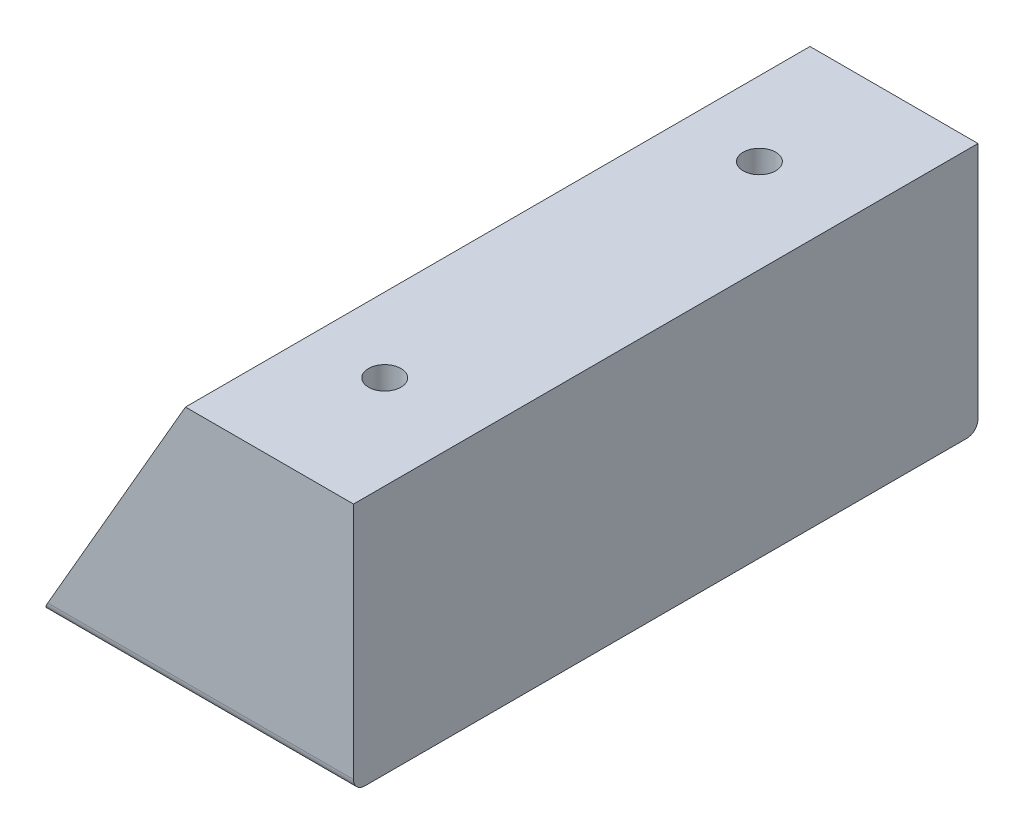
ISO-10303-21;
HEADER;
FILE_DESCRIPTION(('STEP AP214'),'2;1');
FILE_NAME('part.step','',(''),(''),'','','');
FILE_SCHEMA(('AUTOMOTIVE_DESIGN { 1 0 10303 214 1 1 1 1 }'));
ENDSEC;
DATA;
#1=APPLICATION_CONTEXT('core data for automotive mechanical design processes');
#2=APPLICATION_PROTOCOL_DEFINITION('international standard','automotive_design',2000,#1);
#3=PRODUCT_CONTEXT('',#1,'mechanical');
#4=PRODUCT('Part','Part','',(#3));
#5=PRODUCT_RELATED_PRODUCT_CATEGORY('part','',(#4));
#6=PRODUCT_DEFINITION_FORMATION('','',#4);
#7=PRODUCT_DEFINITION_CONTEXT('part definition',#1,'design');
#8=PRODUCT_DEFINITION('design','',#6,#7);
#9=PRODUCT_DEFINITION_SHAPE('','',#8);
#10=(LENGTH_UNIT() NAMED_UNIT(*) SI_UNIT(.MILLI.,.METRE.));
#11=(NAMED_UNIT(*) PLANE_ANGLE_UNIT() SI_UNIT($,.RADIAN.));
#12=(NAMED_UNIT(*) SI_UNIT($,.STERADIAN.) SOLID_ANGLE_UNIT());
#13=UNCERTAINTY_MEASURE_WITH_UNIT(LENGTH_MEASURE(1.E-05),#10,'distance_accuracy_value','');
#14=(GEOMETRIC_REPRESENTATION_CONTEXT(3) GLOBAL_UNCERTAINTY_ASSIGNED_CONTEXT((#13)) GLOBAL_UNIT_ASSIGNED_CONTEXT((#10,
#11,#12)) REPRESENTATION_CONTEXT('',''));
#15=CARTESIAN_POINT('',(0.,0.,0.));
#16=DIRECTION('',(0.,0.,1.));
#17=DIRECTION('',(1.,0.,0.));
#18=AXIS2_PLACEMENT_3D('',#15,#16,#17);
#19=CARTESIAN_POINT('',(23.0940107675853,40.,50.));
#20=DIRECTION('',(0.866025403784436,-0.500000000000004,0.));
#21=DIRECTION('',(0.500000000000004,0.866025403784436,0.));
#22=AXIS2_PLACEMENT_3D('',#19,#20,#21);
#23=PLANE('',#22);
#24=DIRECTION('',(-0.500000000000004,-0.866025403784436,0.));
#25=VECTOR('',#24,1.);
#26=CARTESIAN_POINT('',(23.0940107675853,40.,-50.));
#27=LINE('',#26,#25);
#28=CARTESIAN_POINT('',(23.0940107675853,40.,-50.));
#29=VERTEX_POINT('',#28);
#30=CARTESIAN_POINT('',(1.03923048454134,1.80000000000001,-50.));
#31=VERTEX_POINT('',#30);
#32=EDGE_CURVE('E120',#29,#31,#27,.T.);
#33=ORIENTED_EDGE('',*,*,#32,.T.);
#34=CARTESIAN_POINT('',(1.03923048454134,1.8,-48.2));
#35=DIRECTION('',(0.866025403784436,-0.500000000000004,0.));
#36=DIRECTION('',(0.500000000000004,0.866025403784436,0.));
#37=AXIS2_PLACEMENT_3D('',#34,#35,#36);
#38=ELLIPSE('',#37,2.07846096908266,1.8);
#39=CARTESIAN_POINT('',(0.,0.,-48.2));
#40=VERTEX_POINT('',#39);
#41=EDGE_CURVE('E11',#31,#40,#38,.F.);
#42=ORIENTED_EDGE('',*,*,#41,.T.);
#43=DIRECTION('',(0.,0.,-1.));
#44=VECTOR('',#43,1.);
#45=CARTESIAN_POINT('',(0.,0.,50.));
#46=LINE('',#45,#44);
#47=CARTESIAN_POINT('',(0.,0.,48.2));
#48=VERTEX_POINT('',#47);
#49=EDGE_CURVE('E127',#48,#40,#46,.T.);
#50=ORIENTED_EDGE('',*,*,#49,.F.);
#51=CARTESIAN_POINT('',(1.03923048454134,1.8,48.2));
#52=DIRECTION('',(0.866025403784436,-0.500000000000004,0.));
#53=DIRECTION('',(-0.500000000000004,-0.866025403784436,0.));
#54=AXIS2_PLACEMENT_3D('',#51,#52,#53);
#55=ELLIPSE('',#54,2.07846096908266,1.8);
#56=CARTESIAN_POINT('',(1.03923048454134,1.80000000000001,50.));
#57=VERTEX_POINT('',#56);
#58=EDGE_CURVE('E135',#48,#57,#55,.F.);
#59=ORIENTED_EDGE('',*,*,#58,.T.);
#60=DIRECTION('',(-0.500000000000004,-0.866025403784436,0.));
#61=VECTOR('',#60,1.);
#62=CARTESIAN_POINT('',(23.0940107675853,40.,50.));
#63=LINE('',#62,#61);
#64=CARTESIAN_POINT('',(23.0940107675853,40.,50.));
#65=VERTEX_POINT('',#64);
#66=EDGE_CURVE('E102',#65,#57,#63,.T.);
#67=ORIENTED_EDGE('',*,*,#66,.F.);
#68=DIRECTION('',(0.,0.,-1.));
#69=VECTOR('',#68,1.);
#70=CARTESIAN_POINT('',(23.0940107675853,40.,50.));
#71=LINE('',#70,#69);
#72=EDGE_CURVE('E111',#65,#29,#71,.T.);
#73=ORIENTED_EDGE('',*,*,#72,.T.);
#74=EDGE_LOOP('',(#33,#42,#50,#59,#67,#73));
#75=FACE_BOUND('',#74,.T.);
#76=ADVANCED_FACE('F41',(#75),#23,.F.);
#77=CARTESIAN_POINT('',(0.,0.,50.));
#78=DIRECTION('',(0.,1.,0.));
#79=DIRECTION('',(0.,0.,1.));
#80=AXIS2_PLACEMENT_3D('',#77,#78,#79);
#81=PLANE('',#80);
#82=ORIENTED_EDGE('',*,*,#49,.T.);
#83=DIRECTION('',(1.,0.,0.));
#84=VECTOR('',#83,1.);
#85=CARTESIAN_POINT('',(0.,0.,-48.2));
#86=LINE('',#85,#84);
#87=CARTESIAN_POINT('',(50.,0.,-48.2));
#88=VERTEX_POINT('',#87);
#89=EDGE_CURVE('E137',#40,#88,#86,.T.);
#90=ORIENTED_EDGE('',*,*,#89,.T.);
#91=DIRECTION('',(0.,0.,-1.));
#92=VECTOR('',#91,1.);
#93=CARTESIAN_POINT('',(50.,0.,50.));
#94=LINE('',#93,#92);
#95=CARTESIAN_POINT('',(50.,0.,48.2));
#96=VERTEX_POINT('',#95);
#97=EDGE_CURVE('E110',#96,#88,#94,.T.);
#98=ORIENTED_EDGE('',*,*,#97,.F.);
#99=DIRECTION('',(1.,0.,0.));
#100=VECTOR('',#99,1.);
#101=CARTESIAN_POINT('',(0.,0.,48.2));
#102=LINE('',#101,#100);
#103=EDGE_CURVE('E133',#96,#48,#102,.F.);
#104=ORIENTED_EDGE('',*,*,#103,.T.);
#105=EDGE_LOOP('',(#82,#90,#98,#104));
#106=FACE_BOUND('',#105,.T.);
#107=ADVANCED_FACE('F143',(#106),#81,.F.);
#108=CARTESIAN_POINT('',(50.,0.,50.));
#109=DIRECTION('',(-1.,0.,0.));
#110=DIRECTION('',(0.,0.,1.));
#111=AXIS2_PLACEMENT_3D('',#108,#109,#110);
#112=PLANE('',#111);
#113=ORIENTED_EDGE('',*,*,#97,.T.);
#114=CARTESIAN_POINT('',(50.,1.8,-48.2));
#115=DIRECTION('',(-1.,0.,0.));
#116=DIRECTION('',(0.,0.,1.));
#117=AXIS2_PLACEMENT_3D('',#114,#115,#116);
#118=CIRCLE('',#117,1.8);
#119=CARTESIAN_POINT('',(50.,1.8,-50.));
#120=VERTEX_POINT('',#119);
#121=EDGE_CURVE('E63',#88,#120,#118,.F.);
#122=ORIENTED_EDGE('',*,*,#121,.T.);
#123=DIRECTION('',(0.,1.,0.));
#124=VECTOR('',#123,1.);
#125=CARTESIAN_POINT('',(50.,0.,-50.));
#126=LINE('',#125,#124);
#127=CARTESIAN_POINT('',(50.,40.,-50.));
#128=VERTEX_POINT('',#127);
#129=EDGE_CURVE('E107',#120,#128,#126,.T.);
#130=ORIENTED_EDGE('',*,*,#129,.T.);
#131=DIRECTION('',(0.,0.,-1.));
#132=VECTOR('',#131,1.);
#133=CARTESIAN_POINT('',(50.,40.,50.));
#134=LINE('',#133,#132);
#135=CARTESIAN_POINT('',(50.,40.,50.));
#136=VERTEX_POINT('',#135);
#137=EDGE_CURVE('E105',#136,#128,#134,.T.);
#138=ORIENTED_EDGE('',*,*,#137,.F.);
#139=DIRECTION('',(0.,1.,0.));
#140=VECTOR('',#139,1.);
#141=CARTESIAN_POINT('',(50.,0.,50.));
#142=LINE('',#141,#140);
#143=CARTESIAN_POINT('',(50.,1.8,50.));
#144=VERTEX_POINT('',#143);
#145=EDGE_CURVE('E93',#144,#136,#142,.T.);
#146=ORIENTED_EDGE('',*,*,#145,.F.);
#147=CARTESIAN_POINT('',(50.,1.8,48.2));
#148=DIRECTION('',(-1.,0.,0.));
#149=DIRECTION('',(0.,0.,1.));
#150=AXIS2_PLACEMENT_3D('',#147,#148,#149);
#151=CIRCLE('',#150,1.8);
#152=EDGE_CURVE('E131',#144,#96,#151,.F.);
#153=ORIENTED_EDGE('',*,*,#152,.T.);
#154=EDGE_LOOP('',(#113,#122,#130,#138,#146,#153));
#155=FACE_BOUND('',#154,.T.);
#156=ADVANCED_FACE('F106',(#155),#112,.F.);
#157=CARTESIAN_POINT('',(50.,40.,50.));
#158=DIRECTION('',(0.,-1.,0.));
#159=DIRECTION('',(0.,0.,-1.));
#160=AXIS2_PLACEMENT_3D('',#157,#158,#159);
#161=PLANE('',#160);
#162=CARTESIAN_POINT('',(35.,40.,-30.));
#163=DIRECTION('',(0.,1.,0.));
#164=DIRECTION('',(0.,0.,1.));
#165=AXIS2_PLACEMENT_3D('',#162,#163,#164);
#166=CIRCLE('',#165,2.6);
#167=CARTESIAN_POINT('',(35.,40.,-27.4));
#168=VERTEX_POINT('',#167);
#169=EDGE_CURVE('E192',#168,#168,#166,.T.);
#170=ORIENTED_EDGE('',*,*,#169,.F.);
#171=EDGE_LOOP('',(#170));
#172=FACE_BOUND('',#171,.T.);
#173=CARTESIAN_POINT('',(35.,40.,30.));
#174=DIRECTION('',(0.,1.,0.));
#175=DIRECTION('',(0.,0.,1.));
#176=AXIS2_PLACEMENT_3D('',#173,#174,#175);
#177=CIRCLE('',#176,2.6);
#178=CARTESIAN_POINT('',(35.,40.,32.6));
#179=VERTEX_POINT('',#178);
#180=EDGE_CURVE('E200',#179,#179,#177,.T.);
#181=ORIENTED_EDGE('',*,*,#180,.F.);
#182=EDGE_LOOP('',(#181));
#183=FACE_BOUND('',#182,.T.);
#184=DIRECTION('',(-1.,0.,0.));
#185=VECTOR('',#184,1.);
#186=CARTESIAN_POINT('',(50.,40.,-50.));
#187=LINE('',#186,#185);
#188=EDGE_CURVE('E124',#128,#29,#187,.T.);
#189=ORIENTED_EDGE('',*,*,#188,.T.);
#190=ORIENTED_EDGE('',*,*,#72,.F.);
#191=DIRECTION('',(-1.,0.,0.));
#192=VECTOR('',#191,1.);
#193=CARTESIAN_POINT('',(50.,40.,50.));
#194=LINE('',#193,#192);
#195=EDGE_CURVE('E98',#136,#65,#194,.T.);
#196=ORIENTED_EDGE('',*,*,#195,.F.);
#197=ORIENTED_EDGE('',*,*,#137,.T.);
#198=EDGE_LOOP('',(#189,#190,#196,#197));
#199=FACE_BOUND('',#198,.T.);
#200=ADVANCED_FACE('F113',(#172,#183,#199),#161,.F.);
#201=CARTESIAN_POINT('',(0.,0.,50.));
#202=DIRECTION('',(0.,0.,1.));
#203=DIRECTION('',(1.,0.,0.));
#204=AXIS2_PLACEMENT_3D('',#201,#202,#203);
#205=PLANE('',#204);
#206=ORIENTED_EDGE('',*,*,#66,.T.);
#207=DIRECTION('',(1.,0.,0.));
#208=VECTOR('',#207,1.);
#209=CARTESIAN_POINT('',(50.,1.8,50.));
#210=LINE('',#209,#208);
#211=EDGE_CURVE('E101',#57,#144,#210,.T.);
#212=ORIENTED_EDGE('',*,*,#211,.T.);
#213=ORIENTED_EDGE('',*,*,#145,.T.);
#214=ORIENTED_EDGE('',*,*,#195,.T.);
#215=EDGE_LOOP('',(#206,#212,#213,#214));
#216=FACE_BOUND('',#215,.T.);
#217=ADVANCED_FACE('F96',(#216),#205,.T.);
#218=CARTESIAN_POINT('',(0.,0.,-50.));
#219=DIRECTION('',(0.,0.,1.));
#220=DIRECTION('',(1.,0.,0.));
#221=AXIS2_PLACEMENT_3D('',#218,#219,#220);
#222=PLANE('',#221);
#223=ORIENTED_EDGE('',*,*,#129,.F.);
#224=DIRECTION('',(1.,0.,0.));
#225=VECTOR('',#224,1.);
#226=CARTESIAN_POINT('',(0.,1.8,-50.));
#227=LINE('',#226,#225);
#228=EDGE_CURVE('E49',#120,#31,#227,.F.);
#229=ORIENTED_EDGE('',*,*,#228,.T.);
#230=ORIENTED_EDGE('',*,*,#32,.F.);
#231=ORIENTED_EDGE('',*,*,#188,.F.);
#232=EDGE_LOOP('',(#223,#229,#230,#231));
#233=FACE_BOUND('',#232,.T.);
#234=ADVANCED_FACE('F169',(#233),#222,.F.);
#235=CARTESIAN_POINT('',(35.,25.,30.));
#236=DIRECTION('',(0.,1.,0.));
#237=DIRECTION('',(0.,0.,1.));
#238=AXIS2_PLACEMENT_3D('',#235,#236,#237);
#239=CYLINDRICAL_SURFACE('',#238,2.6);
#240=CARTESIAN_POINT('',(35.,25.,30.));
#241=DIRECTION('',(0.,1.,0.));
#242=DIRECTION('',(0.,0.,1.));
#243=AXIS2_PLACEMENT_3D('',#240,#241,#242);
#244=CIRCLE('',#243,2.6);
#245=CARTESIAN_POINT('',(35.,25.,32.6));
#246=VERTEX_POINT('',#245);
#247=EDGE_CURVE('E195',#246,#246,#244,.T.);
#248=ORIENTED_EDGE('',*,*,#247,.F.);
#249=EDGE_LOOP('',(#248));
#250=FACE_BOUND('',#249,.T.);
#251=ORIENTED_EDGE('',*,*,#180,.T.);
#252=EDGE_LOOP('',(#251));
#253=FACE_BOUND('',#252,.T.);
#254=ADVANCED_FACE('F172',(#250,#253),#239,.F.);
#255=CARTESIAN_POINT('',(35.,25.,30.));
#256=DIRECTION('',(0.,1.,0.));
#257=DIRECTION('',(0.,0.,1.));
#258=AXIS2_PLACEMENT_3D('',#255,#256,#257);
#259=PLANE('',#258);
#260=ORIENTED_EDGE('',*,*,#247,.T.);
#261=EDGE_LOOP('',(#260));
#262=FACE_BOUND('',#261,.T.);
#263=ADVANCED_FACE('F177',(#262),#259,.T.);
#264=CARTESIAN_POINT('',(35.,25.,-30.));
#265=DIRECTION('',(0.,1.,0.));
#266=DIRECTION('',(0.,0.,1.));
#267=AXIS2_PLACEMENT_3D('',#264,#265,#266);
#268=CYLINDRICAL_SURFACE('',#267,2.6);
#269=CARTESIAN_POINT('',(35.,25.,-30.));
#270=DIRECTION('',(0.,1.,0.));
#271=DIRECTION('',(0.,0.,1.));
#272=AXIS2_PLACEMENT_3D('',#269,#270,#271);
#273=CIRCLE('',#272,2.6);
#274=CARTESIAN_POINT('',(35.,25.,-27.4));
#275=VERTEX_POINT('',#274);
#276=EDGE_CURVE('E122',#275,#275,#273,.T.);
#277=ORIENTED_EDGE('',*,*,#276,.F.);
#278=EDGE_LOOP('',(#277));
#279=FACE_BOUND('',#278,.T.);
#280=ORIENTED_EDGE('',*,*,#169,.T.);
#281=EDGE_LOOP('',(#280));
#282=FACE_BOUND('',#281,.T.);
#283=ADVANCED_FACE('F181',(#279,#282),#268,.F.);
#284=CARTESIAN_POINT('',(35.,25.,-30.));
#285=DIRECTION('',(0.,1.,0.));
#286=DIRECTION('',(0.,0.,1.));
#287=AXIS2_PLACEMENT_3D('',#284,#285,#286);
#288=PLANE('',#287);
#289=ORIENTED_EDGE('',*,*,#276,.T.);
#290=EDGE_LOOP('',(#289));
#291=FACE_BOUND('',#290,.T.);
#292=ADVANCED_FACE('F156',(#291),#288,.T.);
#293=CARTESIAN_POINT('',(0.,1.8,48.2));
#294=DIRECTION('',(-1.,0.,0.));
#295=DIRECTION('',(0.,0.,1.));
#296=AXIS2_PLACEMENT_3D('',#293,#294,#295);
#297=CYLINDRICAL_SURFACE('',#296,1.8);
#298=ORIENTED_EDGE('',*,*,#58,.F.);
#299=ORIENTED_EDGE('',*,*,#103,.F.);
#300=ORIENTED_EDGE('',*,*,#152,.F.);
#301=ORIENTED_EDGE('',*,*,#211,.F.);
#302=EDGE_LOOP('',(#298,#299,#300,#301));
#303=FACE_BOUND('',#302,.T.);
#304=ADVANCED_FACE('F150',(#303),#297,.T.);
#305=CARTESIAN_POINT('',(0.,1.8,-48.2));
#306=DIRECTION('',(1.,0.,0.));
#307=DIRECTION('',(0.,0.,-1.));
#308=AXIS2_PLACEMENT_3D('',#305,#306,#307);
#309=CYLINDRICAL_SURFACE('',#308,1.8);
#310=ORIENTED_EDGE('',*,*,#41,.F.);
#311=ORIENTED_EDGE('',*,*,#228,.F.);
#312=ORIENTED_EDGE('',*,*,#121,.F.);
#313=ORIENTED_EDGE('',*,*,#89,.F.);
#314=EDGE_LOOP('',(#310,#311,#312,#313));
#315=FACE_BOUND('',#314,.T.);
#316=ADVANCED_FACE('F43',(#315),#309,.T.);
#317=CLOSED_SHELL('',(#76,#107,#156,#200,#217,#234,#254,#263,#283,#292,#304,#316));
#318=MANIFOLD_SOLID_BREP('B2',#317);
#319=ADVANCED_BREP_SHAPE_REPRESENTATION('',(#18,#318),#14);
#320=SHAPE_DEFINITION_REPRESENTATION(#9,#319);
ENDSEC;
END-ISO-10303-21;
